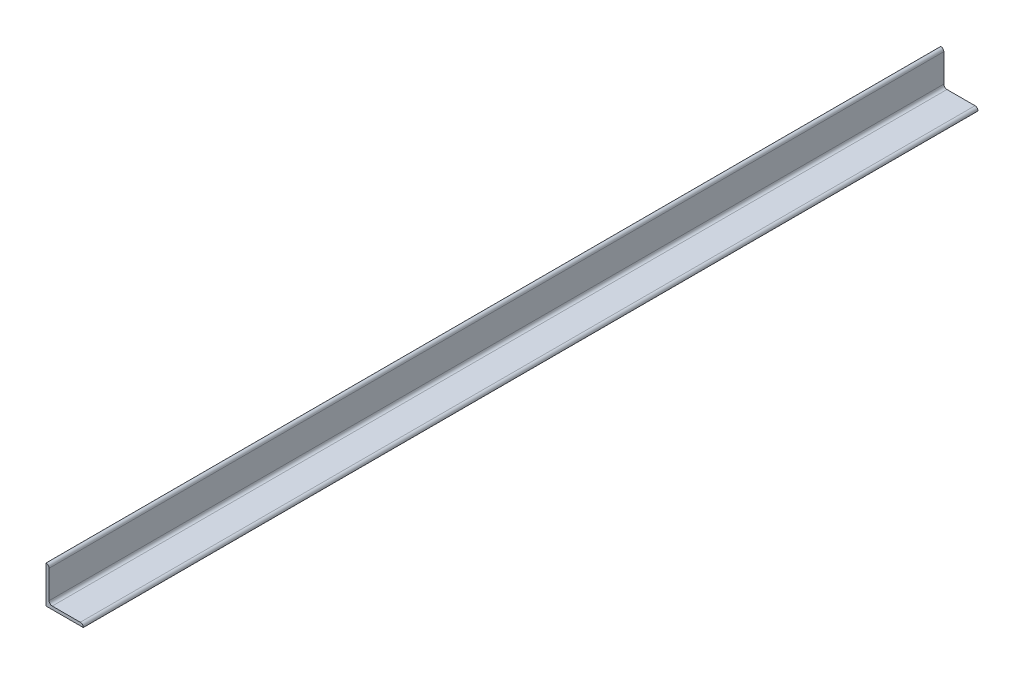
ISO-10303-21;
HEADER;
FILE_DESCRIPTION(('STEP AP214'),'2;1');
FILE_NAME('part.step','',(''),(''),'','','');
FILE_SCHEMA(('AUTOMOTIVE_DESIGN { 1 0 10303 214 1 1 1 1 }'));
ENDSEC;
DATA;
#1=APPLICATION_CONTEXT('core data for automotive mechanical design processes');
#2=APPLICATION_PROTOCOL_DEFINITION('international standard','automotive_design',2000,#1);
#3=PRODUCT_CONTEXT('',#1,'mechanical');
#4=PRODUCT('Part','Part','',(#3));
#5=PRODUCT_RELATED_PRODUCT_CATEGORY('part','',(#4));
#6=PRODUCT_DEFINITION_FORMATION('','',#4);
#7=PRODUCT_DEFINITION_CONTEXT('part definition',#1,'design');
#8=PRODUCT_DEFINITION('design','',#6,#7);
#9=PRODUCT_DEFINITION_SHAPE('','',#8);
#10=(LENGTH_UNIT() NAMED_UNIT(*) SI_UNIT(.MILLI.,.METRE.));
#11=(NAMED_UNIT(*) PLANE_ANGLE_UNIT() SI_UNIT($,.RADIAN.));
#12=(NAMED_UNIT(*) SI_UNIT($,.STERADIAN.) SOLID_ANGLE_UNIT());
#13=UNCERTAINTY_MEASURE_WITH_UNIT(LENGTH_MEASURE(1.E-05),#10,'distance_accuracy_value','');
#14=(GEOMETRIC_REPRESENTATION_CONTEXT(3) GLOBAL_UNCERTAINTY_ASSIGNED_CONTEXT((#13)) GLOBAL_UNIT_ASSIGNED_CONTEXT((#10,
#11,#12)) REPRESENTATION_CONTEXT('',''));
#15=CARTESIAN_POINT('',(0.,0.,0.));
#16=DIRECTION('',(0.,0.,1.));
#17=DIRECTION('',(1.,0.,0.));
#18=AXIS2_PLACEMENT_3D('',#15,#16,#17);
#19=CARTESIAN_POINT('',(43.7815789473685,-33.4177105263157,0.));
#20=DIRECTION('',(1.,0.,0.));
#21=DIRECTION('',(0.,0.,-1.));
#22=AXIS2_PLACEMENT_3D('',#19,#20,#21);
#23=PLANE('',#22);
#24=DIRECTION('',(0.,1.,0.));
#25=VECTOR('',#24,1.);
#26=CARTESIAN_POINT('',(43.7815789473685,-33.4177105263157,1828.8));
#27=LINE('',#26,#25);
#28=CARTESIAN_POINT('',(43.7815789473685,-33.4177105263157,1828.8));
#29=VERTEX_POINT('',#28);
#30=CARTESIAN_POINT('',(43.7815789473685,-33.6717105263157,1828.8));
#31=VERTEX_POINT('',#30);
#32=EDGE_CURVE('E149',#29,#31,#27,.F.);
#33=ORIENTED_EDGE('',*,*,#32,.T.);
#34=DIRECTION('',(0.,0.,-1.));
#35=VECTOR('',#34,1.);
#36=CARTESIAN_POINT('',(43.7815789473685,-33.6717105263157,0.));
#37=LINE('',#36,#35);
#38=CARTESIAN_POINT('',(43.7815789473685,-33.6717105263157,0.));
#39=VERTEX_POINT('',#38);
#40=EDGE_CURVE('E152',#39,#31,#37,.F.);
#41=ORIENTED_EDGE('',*,*,#40,.F.);
#42=DIRECTION('',(0.,1.,0.));
#43=VECTOR('',#42,1.);
#44=CARTESIAN_POINT('',(43.7815789473685,-11.7831722311661,0.));
#45=LINE('',#44,#43);
#46=CARTESIAN_POINT('',(43.7815789473685,-33.4177105263157,0.));
#47=VERTEX_POINT('',#46);
#48=EDGE_CURVE('E84',#39,#47,#45,.T.);
#49=ORIENTED_EDGE('',*,*,#48,.T.);
#50=DIRECTION('',(0.,0.,1.));
#51=VECTOR('',#50,1.);
#52=CARTESIAN_POINT('',(43.7815789473685,-33.4177105263157,0.));
#53=LINE('',#52,#51);
#54=EDGE_CURVE('E94',#29,#47,#53,.F.);
#55=ORIENTED_EDGE('',*,*,#54,.F.);
#56=EDGE_LOOP('',(#33,#41,#49,#55));
#57=FACE_BOUND('',#56,.T.);
#58=ADVANCED_FACE('F17',(#57),#23,.T.);
#59=CARTESIAN_POINT('',(-26.0684210526315,36.4322894736843,0.));
#60=DIRECTION('',(1.,0.,0.));
#61=DIRECTION('',(0.,0.,-1.));
#62=AXIS2_PLACEMENT_3D('',#59,#60,#61);
#63=PLANE('',#62);
#64=DIRECTION('',(0.,1.,0.));
#65=VECTOR('',#64,1.);
#66=CARTESIAN_POINT('',(-26.0684210526315,-11.7831722311661,1828.8));
#67=LINE('',#66,#65);
#68=CARTESIAN_POINT('',(-26.0684210526316,-20.9717105263158,1828.8));
#69=VERTEX_POINT('',#68);
#70=CARTESIAN_POINT('',(-26.0684210526315,36.4322894736843,1828.8));
#71=VERTEX_POINT('',#70);
#72=EDGE_CURVE('E155',#69,#71,#67,.T.);
#73=ORIENTED_EDGE('',*,*,#72,.F.);
#74=DIRECTION('',(0.,0.,1.));
#75=VECTOR('',#74,1.);
#76=CARTESIAN_POINT('',(-26.0684210526316,-20.9717105263158,0.));
#77=LINE('',#76,#75);
#78=CARTESIAN_POINT('',(-26.0684210526316,-20.9717105263158,0.));
#79=VERTEX_POINT('',#78);
#80=EDGE_CURVE('E104',#69,#79,#77,.F.);
#81=ORIENTED_EDGE('',*,*,#80,.T.);
#82=DIRECTION('',(0.,1.,0.));
#83=VECTOR('',#82,1.);
#84=CARTESIAN_POINT('',(-26.0684210526315,-11.7831722311661,0.));
#85=LINE('',#84,#83);
#86=CARTESIAN_POINT('',(-26.0684210526315,36.4322894736843,0.));
#87=VERTEX_POINT('',#86);
#88=EDGE_CURVE('E113',#79,#87,#85,.T.);
#89=ORIENTED_EDGE('',*,*,#88,.T.);
#90=DIRECTION('',(0.,0.,1.));
#91=VECTOR('',#90,1.);
#92=CARTESIAN_POINT('',(-26.0684210526315,36.4322894736843,0.));
#93=LINE('',#92,#91);
#94=EDGE_CURVE('E118',#71,#87,#93,.F.);
#95=ORIENTED_EDGE('',*,*,#94,.F.);
#96=EDGE_LOOP('',(#73,#81,#89,#95));
#97=FACE_BOUND('',#96,.T.);
#98=ADVANCED_FACE('F182',(#97),#63,.T.);
#99=CARTESIAN_POINT('',(37.6855789473685,-33.4177105263157,0.));
#100=DIRECTION('',(0.,0.,1.));
#101=DIRECTION('',(1.,0.,0.));
#102=AXIS2_PLACEMENT_3D('',#99,#100,#101);
#103=CYLINDRICAL_SURFACE('',#102,6.096);
#104=CARTESIAN_POINT('',(37.6855789473685,-33.4177105263157,1828.8));
#105=DIRECTION('',(0.,0.,1.));
#106=DIRECTION('',(1.,0.,0.));
#107=AXIS2_PLACEMENT_3D('',#104,#105,#106);
#108=CIRCLE('',#107,6.096);
#109=CARTESIAN_POINT('',(37.6855789473685,-27.3217105263157,1828.8));
#110=VERTEX_POINT('',#109);
#111=EDGE_CURVE('E170',#29,#110,#108,.T.);
#112=ORIENTED_EDGE('',*,*,#111,.F.);
#113=ORIENTED_EDGE('',*,*,#54,.T.);
#114=CARTESIAN_POINT('',(37.6855789473685,-33.4177105263157,0.));
#115=DIRECTION('',(0.,0.,1.));
#116=DIRECTION('',(1.,0.,0.));
#117=AXIS2_PLACEMENT_3D('',#114,#115,#116);
#118=CIRCLE('',#117,6.096);
#119=CARTESIAN_POINT('',(37.6855789473685,-27.3217105263157,0.));
#120=VERTEX_POINT('',#119);
#121=EDGE_CURVE('E20',#47,#120,#118,.T.);
#122=ORIENTED_EDGE('',*,*,#121,.T.);
#123=DIRECTION('',(0.,0.,1.));
#124=VECTOR('',#123,1.);
#125=CARTESIAN_POINT('',(37.6855789473685,-27.3217105263157,0.));
#126=LINE('',#125,#124);
#127=EDGE_CURVE('E92',#110,#120,#126,.F.);
#128=ORIENTED_EDGE('',*,*,#127,.F.);
#129=EDGE_LOOP('',(#112,#113,#122,#128));
#130=FACE_BOUND('',#129,.T.);
#131=ADVANCED_FACE('F91',(#130),#103,.T.);
#132=CARTESIAN_POINT('',(-19.7184210526316,-27.3217105263157,0.));
#133=DIRECTION('',(0.,1.,0.));
#134=DIRECTION('',(0.,0.,1.));
#135=AXIS2_PLACEMENT_3D('',#132,#133,#134);
#136=PLANE('',#135);
#137=DIRECTION('',(1.,0.,0.));
#138=VECTOR('',#137,1.);
#139=CARTESIAN_POINT('',(-10.5298827574819,-27.3217105263157,1828.8));
#140=LINE('',#139,#138);
#141=CARTESIAN_POINT('',(-19.7184210526316,-27.3217105263158,1828.8));
#142=VERTEX_POINT('',#141);
#143=EDGE_CURVE('E102',#110,#142,#140,.F.);
#144=ORIENTED_EDGE('',*,*,#143,.F.);
#145=ORIENTED_EDGE('',*,*,#127,.T.);
#146=DIRECTION('',(1.,0.,0.));
#147=VECTOR('',#146,1.);
#148=CARTESIAN_POINT('',(-10.5298827574819,-27.3217105263157,0.));
#149=LINE('',#148,#147);
#150=CARTESIAN_POINT('',(-19.7184210526316,-27.3217105263158,0.));
#151=VERTEX_POINT('',#150);
#152=EDGE_CURVE('E97',#120,#151,#149,.F.);
#153=ORIENTED_EDGE('',*,*,#152,.T.);
#154=DIRECTION('',(0.,0.,1.));
#155=VECTOR('',#154,1.);
#156=CARTESIAN_POINT('',(-19.7184210526315,-27.3217105263158,0.));
#157=LINE('',#156,#155);
#158=EDGE_CURVE('E145',#151,#142,#157,.T.);
#159=ORIENTED_EDGE('',*,*,#158,.T.);
#160=EDGE_LOOP('',(#144,#145,#153,#159));
#161=FACE_BOUND('',#160,.T.);
#162=ADVANCED_FACE('F99',(#161),#136,.T.);
#163=CARTESIAN_POINT('',(-19.7184210526316,-20.9717105263158,0.));
#164=DIRECTION('',(0.,0.,1.));
#165=DIRECTION('',(1.,0.,0.));
#166=AXIS2_PLACEMENT_3D('',#163,#164,#165);
#167=CYLINDRICAL_SURFACE('',#166,6.35);
#168=CARTESIAN_POINT('',(-19.7184210526316,-20.9717105263158,0.));
#169=DIRECTION('',(0.,0.,1.));
#170=DIRECTION('',(1.,0.,0.));
#171=AXIS2_PLACEMENT_3D('',#168,#169,#170);
#172=CIRCLE('',#171,6.35);
#173=EDGE_CURVE('E111',#151,#79,#172,.F.);
#174=ORIENTED_EDGE('',*,*,#173,.T.);
#175=ORIENTED_EDGE('',*,*,#80,.F.);
#176=CARTESIAN_POINT('',(-19.7184210526316,-20.9717105263158,1828.8));
#177=DIRECTION('',(0.,0.,1.));
#178=DIRECTION('',(1.,0.,0.));
#179=AXIS2_PLACEMENT_3D('',#176,#177,#178);
#180=CIRCLE('',#179,6.35);
#181=EDGE_CURVE('E138',#142,#69,#180,.F.);
#182=ORIENTED_EDGE('',*,*,#181,.F.);
#183=ORIENTED_EDGE('',*,*,#158,.F.);
#184=EDGE_LOOP('',(#174,#175,#182,#183));
#185=FACE_BOUND('',#184,.T.);
#186=ADVANCED_FACE('F201',(#185),#167,.F.);
#187=CARTESIAN_POINT('',(-32.1644210526315,36.4322894736843,0.));
#188=DIRECTION('',(0.,0.,1.));
#189=DIRECTION('',(1.,0.,0.));
#190=AXIS2_PLACEMENT_3D('',#187,#188,#189);
#191=CYLINDRICAL_SURFACE('',#190,6.096);
#192=CARTESIAN_POINT('',(-32.1644210526315,36.4322894736843,1828.8));
#193=DIRECTION('',(0.,0.,1.));
#194=DIRECTION('',(1.,0.,0.));
#195=AXIS2_PLACEMENT_3D('',#192,#193,#194);
#196=CIRCLE('',#195,6.096);
#197=CARTESIAN_POINT('',(-32.1644210526315,42.5282894736843,1828.8));
#198=VERTEX_POINT('',#197);
#199=EDGE_CURVE('E171',#71,#198,#196,.T.);
#200=ORIENTED_EDGE('',*,*,#199,.F.);
#201=ORIENTED_EDGE('',*,*,#94,.T.);
#202=CARTESIAN_POINT('',(-32.1644210526315,36.4322894736843,0.));
#203=DIRECTION('',(0.,0.,1.));
#204=DIRECTION('',(1.,0.,0.));
#205=AXIS2_PLACEMENT_3D('',#202,#203,#204);
#206=CIRCLE('',#205,6.096);
#207=CARTESIAN_POINT('',(-32.1644210526315,42.5282894736843,0.));
#208=VERTEX_POINT('',#207);
#209=EDGE_CURVE('E161',#87,#208,#206,.T.);
#210=ORIENTED_EDGE('',*,*,#209,.T.);
#211=DIRECTION('',(0.,0.,1.));
#212=VECTOR('',#211,1.);
#213=CARTESIAN_POINT('',(-32.1644210526315,42.5282894736843,0.));
#214=LINE('',#213,#212);
#215=EDGE_CURVE('E121',#198,#208,#214,.F.);
#216=ORIENTED_EDGE('',*,*,#215,.F.);
#217=EDGE_LOOP('',(#200,#201,#210,#216));
#218=FACE_BOUND('',#217,.T.);
#219=ADVANCED_FACE('F185',(#218),#191,.T.);
#220=CARTESIAN_POINT('',(-10.5298827574819,-11.7831722311661,0.));
#221=DIRECTION('',(0.,0.,1.));
#222=DIRECTION('',(1.,0.,0.));
#223=AXIS2_PLACEMENT_3D('',#220,#221,#222);
#224=PLANE('',#223);
#225=ORIENTED_EDGE('',*,*,#209,.F.);
#226=ORIENTED_EDGE('',*,*,#88,.F.);
#227=ORIENTED_EDGE('',*,*,#173,.F.);
#228=ORIENTED_EDGE('',*,*,#152,.F.);
#229=ORIENTED_EDGE('',*,*,#121,.F.);
#230=ORIENTED_EDGE('',*,*,#48,.F.);
#231=DIRECTION('',(1.,0.,0.));
#232=VECTOR('',#231,1.);
#233=CARTESIAN_POINT('',(43.7815789473685,-33.6717105263157,0.));
#234=LINE('',#233,#232);
#235=CARTESIAN_POINT('',(-32.4184210526315,-33.6717105263157,0.));
#236=VERTEX_POINT('',#235);
#237=EDGE_CURVE('E156',#236,#39,#234,.T.);
#238=ORIENTED_EDGE('',*,*,#237,.F.);
#239=DIRECTION('',(0.,1.,0.));
#240=VECTOR('',#239,1.);
#241=CARTESIAN_POINT('',(-32.4184210526315,-33.6717105263157,0.));
#242=LINE('',#241,#240);
#243=CARTESIAN_POINT('',(-32.4184210526315,42.5282894736843,0.));
#244=VERTEX_POINT('',#243);
#245=EDGE_CURVE('E124',#244,#236,#242,.F.);
#246=ORIENTED_EDGE('',*,*,#245,.F.);
#247=DIRECTION('',(1.,0.,0.));
#248=VECTOR('',#247,1.);
#249=CARTESIAN_POINT('',(-32.4184210526315,42.5282894736843,0.));
#250=LINE('',#249,#248);
#251=EDGE_CURVE('E126',#208,#244,#250,.F.);
#252=ORIENTED_EDGE('',*,*,#251,.F.);
#253=EDGE_LOOP('',(#225,#226,#227,#228,#229,#230,#238,#246,#252));
#254=FACE_BOUND('',#253,.T.);
#255=ADVANCED_FACE('F108',(#254),#224,.F.);
#256=CARTESIAN_POINT('',(43.7815789473685,-33.6717105263157,0.));
#257=DIRECTION('',(0.,-1.,0.));
#258=DIRECTION('',(0.,0.,-1.));
#259=AXIS2_PLACEMENT_3D('',#256,#257,#258);
#260=PLANE('',#259);
#261=DIRECTION('',(1.,0.,0.));
#262=VECTOR('',#261,1.);
#263=CARTESIAN_POINT('',(-10.5298827574819,-33.6717105263157,1828.8));
#264=LINE('',#263,#262);
#265=CARTESIAN_POINT('',(-32.4184210526315,-33.6717105263157,1828.8));
#266=VERTEX_POINT('',#265);
#267=EDGE_CURVE('E167',#266,#31,#264,.T.);
#268=ORIENTED_EDGE('',*,*,#267,.F.);
#269=DIRECTION('',(0.,0.,1.));
#270=VECTOR('',#269,1.);
#271=CARTESIAN_POINT('',(-32.4184210526315,-33.6717105263157,0.));
#272=LINE('',#271,#270);
#273=EDGE_CURVE('E133',#236,#266,#272,.T.);
#274=ORIENTED_EDGE('',*,*,#273,.F.);
#275=ORIENTED_EDGE('',*,*,#237,.T.);
#276=ORIENTED_EDGE('',*,*,#40,.T.);
#277=EDGE_LOOP('',(#268,#274,#275,#276));
#278=FACE_BOUND('',#277,.T.);
#279=ADVANCED_FACE('F196',(#278),#260,.T.);
#280=CARTESIAN_POINT('',(-10.5298827574819,-11.7831722311661,1828.8));
#281=DIRECTION('',(0.,0.,1.));
#282=DIRECTION('',(1.,0.,0.));
#283=AXIS2_PLACEMENT_3D('',#280,#281,#282);
#284=PLANE('',#283);
#285=ORIENTED_EDGE('',*,*,#143,.T.);
#286=ORIENTED_EDGE('',*,*,#181,.T.);
#287=ORIENTED_EDGE('',*,*,#72,.T.);
#288=ORIENTED_EDGE('',*,*,#199,.T.);
#289=DIRECTION('',(1.,0.,0.));
#290=VECTOR('',#289,1.);
#291=CARTESIAN_POINT('',(-32.4184210526315,42.5282894736843,1828.8));
#292=LINE('',#291,#290);
#293=CARTESIAN_POINT('',(-32.4184210526315,42.5282894736843,1828.8));
#294=VERTEX_POINT('',#293);
#295=EDGE_CURVE('E35',#294,#198,#292,.T.);
#296=ORIENTED_EDGE('',*,*,#295,.F.);
#297=DIRECTION('',(0.,1.,0.));
#298=VECTOR('',#297,1.);
#299=CARTESIAN_POINT('',(-32.4184210526315,-33.6717105263157,1828.8));
#300=LINE('',#299,#298);
#301=EDGE_CURVE('E26',#266,#294,#300,.T.);
#302=ORIENTED_EDGE('',*,*,#301,.F.);
#303=ORIENTED_EDGE('',*,*,#267,.T.);
#304=ORIENTED_EDGE('',*,*,#32,.F.);
#305=ORIENTED_EDGE('',*,*,#111,.T.);
#306=EDGE_LOOP('',(#285,#286,#287,#288,#296,#302,#303,#304,#305));
#307=FACE_BOUND('',#306,.T.);
#308=ADVANCED_FACE('F194',(#307),#284,.T.);
#309=CARTESIAN_POINT('',(-32.4184210526315,42.5282894736843,0.));
#310=DIRECTION('',(0.,1.,0.));
#311=DIRECTION('',(0.,0.,1.));
#312=AXIS2_PLACEMENT_3D('',#309,#310,#311);
#313=PLANE('',#312);
#314=ORIENTED_EDGE('',*,*,#295,.T.);
#315=ORIENTED_EDGE('',*,*,#215,.T.);
#316=ORIENTED_EDGE('',*,*,#251,.T.);
#317=DIRECTION('',(0.,0.,1.));
#318=VECTOR('',#317,1.);
#319=CARTESIAN_POINT('',(-32.4184210526315,42.5282894736843,0.));
#320=LINE('',#319,#318);
#321=EDGE_CURVE('E11',#294,#244,#320,.F.);
#322=ORIENTED_EDGE('',*,*,#321,.F.);
#323=EDGE_LOOP('',(#314,#315,#316,#322));
#324=FACE_BOUND('',#323,.T.);
#325=ADVANCED_FACE('F189',(#324),#313,.T.);
#326=CARTESIAN_POINT('',(-32.4184210526315,-33.6717105263157,0.));
#327=DIRECTION('',(-1.,0.,0.));
#328=DIRECTION('',(0.,0.,1.));
#329=AXIS2_PLACEMENT_3D('',#326,#327,#328);
#330=PLANE('',#329);
#331=ORIENTED_EDGE('',*,*,#301,.T.);
#332=ORIENTED_EDGE('',*,*,#321,.T.);
#333=ORIENTED_EDGE('',*,*,#245,.T.);
#334=ORIENTED_EDGE('',*,*,#273,.T.);
#335=EDGE_LOOP('',(#331,#332,#333,#334));
#336=FACE_BOUND('',#335,.T.);
#337=ADVANCED_FACE('F192',(#336),#330,.T.);
#338=CLOSED_SHELL('',(#58,#98,#131,#162,#186,#219,#255,#279,#308,#325,#337));
#339=MANIFOLD_SOLID_BREP('B1',#338);
#340=ADVANCED_BREP_SHAPE_REPRESENTATION('',(#18,#339),#14);
#341=SHAPE_DEFINITION_REPRESENTATION(#9,#340);
ENDSEC;
END-ISO-10303-21;
